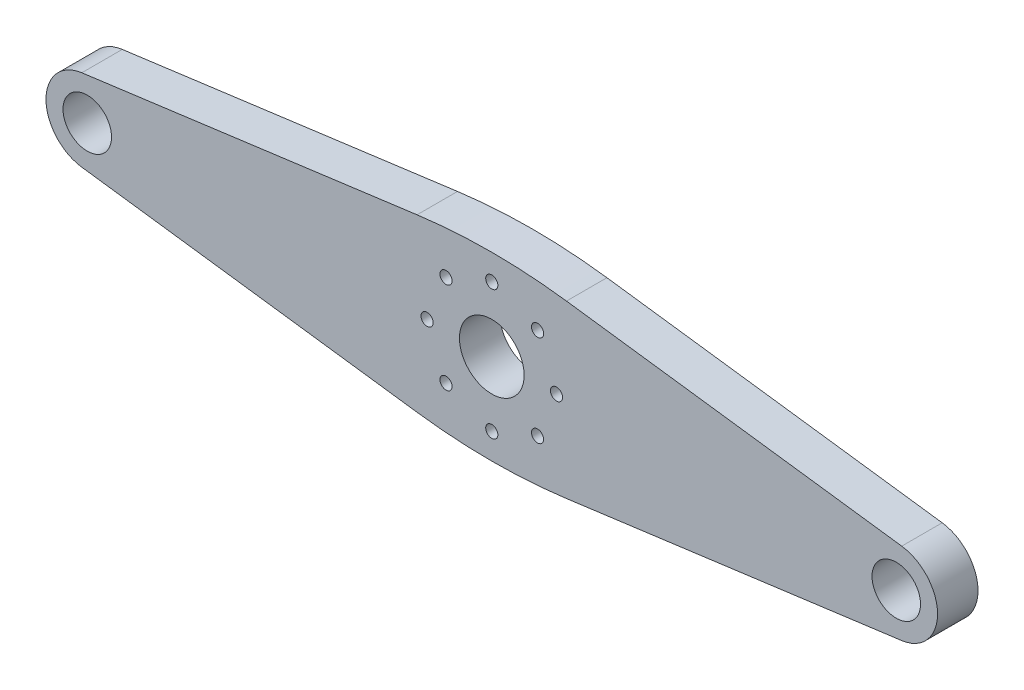
ISO-10303-21;
HEADER;
FILE_DESCRIPTION(('STEP AP214'),'2;1');
FILE_NAME('part.step','',(''),(''),'','','');
FILE_SCHEMA(('AUTOMOTIVE_DESIGN { 1 0 10303 214 1 1 1 1 }'));
ENDSEC;
DATA;
#1=APPLICATION_CONTEXT('core data for automotive mechanical design processes');
#2=APPLICATION_PROTOCOL_DEFINITION('international standard','automotive_design',2000,#1);
#3=PRODUCT_CONTEXT('',#1,'mechanical');
#4=PRODUCT('Part','Part','',(#3));
#5=PRODUCT_RELATED_PRODUCT_CATEGORY('part','',(#4));
#6=PRODUCT_DEFINITION_FORMATION('','',#4);
#7=PRODUCT_DEFINITION_CONTEXT('part definition',#1,'design');
#8=PRODUCT_DEFINITION('design','',#6,#7);
#9=PRODUCT_DEFINITION_SHAPE('','',#8);
#10=(LENGTH_UNIT() NAMED_UNIT(*) SI_UNIT(.MILLI.,.METRE.));
#11=(NAMED_UNIT(*) PLANE_ANGLE_UNIT() SI_UNIT($,.RADIAN.));
#12=(NAMED_UNIT(*) SI_UNIT($,.STERADIAN.) SOLID_ANGLE_UNIT());
#13=UNCERTAINTY_MEASURE_WITH_UNIT(LENGTH_MEASURE(1.E-05),#10,'distance_accuracy_value','');
#14=(GEOMETRIC_REPRESENTATION_CONTEXT(3) GLOBAL_UNCERTAINTY_ASSIGNED_CONTEXT((#13)) GLOBAL_UNIT_ASSIGNED_CONTEXT((#10,
#11,#12)) REPRESENTATION_CONTEXT('',''));
#15=CARTESIAN_POINT('',(0.,0.,0.));
#16=DIRECTION('',(0.,0.,1.));
#17=DIRECTION('',(1.,0.,0.));
#18=AXIS2_PLACEMENT_3D('',#15,#16,#17);
#19=CARTESIAN_POINT('',(50.,0.,5.));
#20=DIRECTION('',(0.,0.,-1.));
#21=DIRECTION('',(-1.,0.,0.));
#22=AXIS2_PLACEMENT_3D('',#19,#20,#21);
#23=PLANE('',#22);
#24=CARTESIAN_POINT('',(50.,0.,5.));
#25=DIRECTION('',(0.,0.,1.));
#26=DIRECTION('',(-1.,0.,0.));
#27=AXIS2_PLACEMENT_3D('',#24,#25,#26);
#28=CIRCLE('',#27,5.10024633771241);
#29=CARTESIAN_POINT('',(50.6728763500851,-5.05566515137672,5.));
#30=VERTEX_POINT('',#29);
#31=CARTESIAN_POINT('',(50.6728763500851,5.05566515137672,5.));
#32=VERTEX_POINT('',#31);
#33=EDGE_CURVE('E145',#30,#32,#28,.T.);
#34=ORIENTED_EDGE('',*,*,#33,.T.);
#35=DIRECTION('',(-0.991259013117456,0.131930166805804,0.));
#36=VECTOR('',#35,1.);
#37=CARTESIAN_POINT('',(50.6728763500851,5.05566515137672,5.));
#38=LINE('',#37,#36);
#39=CARTESIAN_POINT('',(9.2351116764065,10.5707637614413,5.));
#40=VERTEX_POINT('',#39);
#41=EDGE_CURVE('E93',#32,#40,#38,.T.);
#42=ORIENTED_EDGE('',*,*,#41,.T.);
#43=CARTESIAN_POINT('',(0.,-58.8173671567806,5.));
#44=DIRECTION('',(0.,0.,1.));
#45=DIRECTION('',(-1.,0.,0.));
#46=AXIS2_PLACEMENT_3D('',#43,#44,#45);
#47=CIRCLE('',#46,70.);
#48=CARTESIAN_POINT('',(-9.23511167640649,10.5707637614413,5.));
#49=VERTEX_POINT('',#48);
#50=EDGE_CURVE('E160',#40,#49,#47,.T.);
#51=ORIENTED_EDGE('',*,*,#50,.T.);
#52=DIRECTION('',(-0.991259013117456,-0.131930166805804,0.));
#53=VECTOR('',#52,1.);
#54=CARTESIAN_POINT('',(-50.6728763500851,5.05566515137672,5.));
#55=LINE('',#54,#53);
#56=CARTESIAN_POINT('',(-50.6728763500851,5.05566515137672,5.));
#57=VERTEX_POINT('',#56);
#58=EDGE_CURVE('E173',#49,#57,#55,.T.);
#59=ORIENTED_EDGE('',*,*,#58,.T.);
#60=CARTESIAN_POINT('',(-50.,0.,5.));
#61=DIRECTION('',(0.,0.,1.));
#62=DIRECTION('',(1.,0.,0.));
#63=AXIS2_PLACEMENT_3D('',#60,#61,#62);
#64=CIRCLE('',#63,5.10024633771241);
#65=CARTESIAN_POINT('',(-50.6728763500851,-5.05566515137672,5.));
#66=VERTEX_POINT('',#65);
#67=EDGE_CURVE('E112',#57,#66,#64,.T.);
#68=ORIENTED_EDGE('',*,*,#67,.T.);
#69=DIRECTION('',(0.991259013117456,-0.131930166805804,0.));
#70=VECTOR('',#69,1.);
#71=CARTESIAN_POINT('',(-50.6728763500851,-5.05566515137672,5.));
#72=LINE('',#71,#70);
#73=CARTESIAN_POINT('',(-9.23511167640653,-10.5707637614413,5.));
#74=VERTEX_POINT('',#73);
#75=EDGE_CURVE('E106',#66,#74,#72,.T.);
#76=ORIENTED_EDGE('',*,*,#75,.T.);
#77=CARTESIAN_POINT('',(0.,58.8173671567806,5.));
#78=DIRECTION('',(0.,0.,1.));
#79=DIRECTION('',(1.,0.,0.));
#80=AXIS2_PLACEMENT_3D('',#77,#78,#79);
#81=CIRCLE('',#80,70.);
#82=CARTESIAN_POINT('',(9.23511167640649,-10.5707637614413,5.));
#83=VERTEX_POINT('',#82);
#84=EDGE_CURVE('E110',#74,#83,#81,.T.);
#85=ORIENTED_EDGE('',*,*,#84,.T.);
#86=DIRECTION('',(0.991259013117456,0.131930166805804,0.));
#87=VECTOR('',#86,1.);
#88=CARTESIAN_POINT('',(50.6728763500851,-5.05566515137672,5.));
#89=LINE('',#88,#87);
#90=EDGE_CURVE('E50',#83,#30,#89,.T.);
#91=ORIENTED_EDGE('',*,*,#90,.T.);
#92=EDGE_LOOP('',(#34,#42,#51,#59,#68,#76,#85,#91));
#93=FACE_BOUND('',#92,.T.);
#94=CARTESIAN_POINT('',(0.,0.,5.));
#95=DIRECTION('',(0.,0.,1.));
#96=DIRECTION('',(1.,0.,0.));
#97=AXIS2_PLACEMENT_3D('',#94,#95,#96);
#98=CIRCLE('',#97,4.);
#99=CARTESIAN_POINT('',(4.,0.,5.));
#100=VERTEX_POINT('',#99);
#101=EDGE_CURVE('E134',#100,#100,#98,.T.);
#102=ORIENTED_EDGE('',*,*,#101,.F.);
#103=EDGE_LOOP('',(#102));
#104=FACE_BOUND('',#103,.T.);
#105=CARTESIAN_POINT('',(-8.,0.,5.));
#106=DIRECTION('',(0.,0.,1.));
#107=DIRECTION('',(1.,0.,0.));
#108=AXIS2_PLACEMENT_3D('',#105,#106,#107);
#109=CIRCLE('',#108,0.75);
#110=CARTESIAN_POINT('',(-7.25,0.,5.));
#111=VERTEX_POINT('',#110);
#112=EDGE_CURVE('E182',#111,#111,#109,.T.);
#113=ORIENTED_EDGE('',*,*,#112,.F.);
#114=EDGE_LOOP('',(#113));
#115=FACE_BOUND('',#114,.T.);
#116=CARTESIAN_POINT('',(-50.,0.,5.));
#117=DIRECTION('',(0.,0.,1.));
#118=DIRECTION('',(1.,0.,0.));
#119=AXIS2_PLACEMENT_3D('',#116,#117,#118);
#120=CIRCLE('',#119,3.);
#121=CARTESIAN_POINT('',(-47.,0.,5.));
#122=VERTEX_POINT('',#121);
#123=EDGE_CURVE('E188',#122,#122,#120,.T.);
#124=ORIENTED_EDGE('',*,*,#123,.F.);
#125=EDGE_LOOP('',(#124));
#126=FACE_BOUND('',#125,.T.);
#127=CARTESIAN_POINT('',(-5.65685424949237,5.65685424949239,5.));
#128=DIRECTION('',(0.,0.,1.));
#129=DIRECTION('',(1.,0.,0.));
#130=AXIS2_PLACEMENT_3D('',#127,#128,#129);
#131=CIRCLE('',#130,0.75);
#132=CARTESIAN_POINT('',(-4.90685424949237,5.65685424949239,5.));
#133=VERTEX_POINT('',#132);
#134=EDGE_CURVE('E194',#133,#133,#131,.T.);
#135=ORIENTED_EDGE('',*,*,#134,.F.);
#136=EDGE_LOOP('',(#135));
#137=FACE_BOUND('',#136,.T.);
#138=CARTESIAN_POINT('',(0.,8.,5.));
#139=DIRECTION('',(0.,0.,1.));
#140=DIRECTION('',(1.,0.,0.));
#141=AXIS2_PLACEMENT_3D('',#138,#139,#140);
#142=CIRCLE('',#141,0.75);
#143=CARTESIAN_POINT('',(0.75000000000003,8.,5.));
#144=VERTEX_POINT('',#143);
#145=EDGE_CURVE('E200',#144,#144,#142,.T.);
#146=ORIENTED_EDGE('',*,*,#145,.F.);
#147=EDGE_LOOP('',(#146));
#148=FACE_BOUND('',#147,.T.);
#149=CARTESIAN_POINT('',(50.,0.,5.));
#150=DIRECTION('',(0.,0.,1.));
#151=DIRECTION('',(-1.,0.,0.));
#152=AXIS2_PLACEMENT_3D('',#149,#150,#151);
#153=CIRCLE('',#152,3.);
#154=CARTESIAN_POINT('',(47.,0.,5.));
#155=VERTEX_POINT('',#154);
#156=EDGE_CURVE('E206',#155,#155,#153,.T.);
#157=ORIENTED_EDGE('',*,*,#156,.F.);
#158=EDGE_LOOP('',(#157));
#159=FACE_BOUND('',#158,.T.);
#160=CARTESIAN_POINT('',(5.65685424949241,5.65685424949235,5.));
#161=DIRECTION('',(0.,0.,1.));
#162=DIRECTION('',(1.,0.,0.));
#163=AXIS2_PLACEMENT_3D('',#160,#161,#162);
#164=CIRCLE('',#163,0.75);
#165=CARTESIAN_POINT('',(6.40685424949241,5.65685424949235,5.));
#166=VERTEX_POINT('',#165);
#167=EDGE_CURVE('E212',#166,#166,#164,.T.);
#168=ORIENTED_EDGE('',*,*,#167,.F.);
#169=EDGE_LOOP('',(#168));
#170=FACE_BOUND('',#169,.T.);
#171=CARTESIAN_POINT('',(8.,0.,5.));
#172=DIRECTION('',(0.,0.,1.));
#173=DIRECTION('',(1.,0.,0.));
#174=AXIS2_PLACEMENT_3D('',#171,#172,#173);
#175=CIRCLE('',#174,0.75);
#176=CARTESIAN_POINT('',(8.75,0.,5.));
#177=VERTEX_POINT('',#176);
#178=EDGE_CURVE('E218',#177,#177,#175,.T.);
#179=ORIENTED_EDGE('',*,*,#178,.F.);
#180=EDGE_LOOP('',(#179));
#181=FACE_BOUND('',#180,.T.);
#182=CARTESIAN_POINT('',(5.65685424949233,-5.65685424949243,5.));
#183=DIRECTION('',(0.,0.,1.));
#184=DIRECTION('',(1.,0.,0.));
#185=AXIS2_PLACEMENT_3D('',#182,#183,#184);
#186=CIRCLE('',#185,0.750000000000001);
#187=CARTESIAN_POINT('',(6.40685424949233,-5.65685424949243,5.));
#188=VERTEX_POINT('',#187);
#189=EDGE_CURVE('E224',#188,#188,#186,.T.);
#190=ORIENTED_EDGE('',*,*,#189,.F.);
#191=EDGE_LOOP('',(#190));
#192=FACE_BOUND('',#191,.T.);
#193=CARTESIAN_POINT('',(0.,-8.,5.));
#194=DIRECTION('',(0.,0.,1.));
#195=DIRECTION('',(1.,0.,0.));
#196=AXIS2_PLACEMENT_3D('',#193,#194,#195);
#197=CIRCLE('',#196,0.750000000000001);
#198=CARTESIAN_POINT('',(0.749999999999915,-8.,5.));
#199=VERTEX_POINT('',#198);
#200=EDGE_CURVE('E230',#199,#199,#197,.T.);
#201=ORIENTED_EDGE('',*,*,#200,.F.);
#202=EDGE_LOOP('',(#201));
#203=FACE_BOUND('',#202,.T.);
#204=CARTESIAN_POINT('',(-5.65685424949245,-5.65685424949231,5.));
#205=DIRECTION('',(0.,0.,1.));
#206=DIRECTION('',(1.,0.,0.));
#207=AXIS2_PLACEMENT_3D('',#204,#205,#206);
#208=CIRCLE('',#207,0.75);
#209=CARTESIAN_POINT('',(-4.90685424949245,-5.65685424949231,5.));
#210=VERTEX_POINT('',#209);
#211=EDGE_CURVE('E236',#210,#210,#208,.T.);
#212=ORIENTED_EDGE('',*,*,#211,.F.);
#213=EDGE_LOOP('',(#212));
#214=FACE_BOUND('',#213,.T.);
#215=ADVANCED_FACE('F33',(#93,#104,#115,#126,#137,#148,#159,#170,#181,#192,#203,#214),#23,.F.);
#216=CARTESIAN_POINT('',(50.,0.,0.));
#217=DIRECTION('',(0.,0.,-1.));
#218=DIRECTION('',(-1.,0.,0.));
#219=AXIS2_PLACEMENT_3D('',#216,#217,#218);
#220=PLANE('',#219);
#221=CARTESIAN_POINT('',(0.,-8.,0.));
#222=DIRECTION('',(0.,0.,1.));
#223=DIRECTION('',(1.,0.,0.));
#224=AXIS2_PLACEMENT_3D('',#221,#222,#223);
#225=CIRCLE('',#224,0.750000000000001);
#226=CARTESIAN_POINT('',(0.749999999999915,-8.,0.));
#227=VERTEX_POINT('',#226);
#228=EDGE_CURVE('E233',#227,#227,#225,.T.);
#229=ORIENTED_EDGE('',*,*,#228,.T.);
#230=EDGE_LOOP('',(#229));
#231=FACE_BOUND('',#230,.T.);
#232=CARTESIAN_POINT('',(8.,0.,0.));
#233=DIRECTION('',(0.,0.,1.));
#234=DIRECTION('',(1.,0.,0.));
#235=AXIS2_PLACEMENT_3D('',#232,#233,#234);
#236=CIRCLE('',#235,0.75);
#237=CARTESIAN_POINT('',(8.75,0.,0.));
#238=VERTEX_POINT('',#237);
#239=EDGE_CURVE('E221',#238,#238,#236,.T.);
#240=ORIENTED_EDGE('',*,*,#239,.T.);
#241=EDGE_LOOP('',(#240));
#242=FACE_BOUND('',#241,.T.);
#243=CARTESIAN_POINT('',(50.,0.,0.));
#244=DIRECTION('',(0.,0.,1.));
#245=DIRECTION('',(-1.,0.,0.));
#246=AXIS2_PLACEMENT_3D('',#243,#244,#245);
#247=CIRCLE('',#246,3.);
#248=CARTESIAN_POINT('',(47.,0.,0.));
#249=VERTEX_POINT('',#248);
#250=EDGE_CURVE('E209',#249,#249,#247,.T.);
#251=ORIENTED_EDGE('',*,*,#250,.T.);
#252=EDGE_LOOP('',(#251));
#253=FACE_BOUND('',#252,.T.);
#254=CARTESIAN_POINT('',(-5.65685424949237,5.65685424949239,0.));
#255=DIRECTION('',(0.,0.,1.));
#256=DIRECTION('',(1.,0.,0.));
#257=AXIS2_PLACEMENT_3D('',#254,#255,#256);
#258=CIRCLE('',#257,0.75);
#259=CARTESIAN_POINT('',(-4.90685424949237,5.65685424949239,0.));
#260=VERTEX_POINT('',#259);
#261=EDGE_CURVE('E197',#260,#260,#258,.T.);
#262=ORIENTED_EDGE('',*,*,#261,.T.);
#263=EDGE_LOOP('',(#262));
#264=FACE_BOUND('',#263,.T.);
#265=CARTESIAN_POINT('',(-8.,0.,0.));
#266=DIRECTION('',(0.,0.,1.));
#267=DIRECTION('',(1.,0.,0.));
#268=AXIS2_PLACEMENT_3D('',#265,#266,#267);
#269=CIRCLE('',#268,0.75);
#270=CARTESIAN_POINT('',(-7.25,0.,0.));
#271=VERTEX_POINT('',#270);
#272=EDGE_CURVE('E185',#271,#271,#269,.T.);
#273=ORIENTED_EDGE('',*,*,#272,.T.);
#274=EDGE_LOOP('',(#273));
#275=FACE_BOUND('',#274,.T.);
#276=CARTESIAN_POINT('',(50.,0.,0.));
#277=DIRECTION('',(0.,0.,1.));
#278=DIRECTION('',(-1.,0.,0.));
#279=AXIS2_PLACEMENT_3D('',#276,#277,#278);
#280=CIRCLE('',#279,5.10024633771241);
#281=CARTESIAN_POINT('',(50.6728763500851,-5.05566515137672,0.));
#282=VERTEX_POINT('',#281);
#283=CARTESIAN_POINT('',(50.6728763500851,5.05566515137672,0.));
#284=VERTEX_POINT('',#283);
#285=EDGE_CURVE('E130',#282,#284,#280,.T.);
#286=ORIENTED_EDGE('',*,*,#285,.F.);
#287=DIRECTION('',(0.991259013117456,0.131930166805804,0.));
#288=VECTOR('',#287,1.);
#289=CARTESIAN_POINT('',(50.6728763500851,-5.05566515137672,0.));
#290=LINE('',#289,#288);
#291=CARTESIAN_POINT('',(9.23511167640649,-10.5707637614413,0.));
#292=VERTEX_POINT('',#291);
#293=EDGE_CURVE('E85',#292,#282,#290,.T.);
#294=ORIENTED_EDGE('',*,*,#293,.F.);
#295=CARTESIAN_POINT('',(0.,58.8173671567806,0.));
#296=DIRECTION('',(0.,0.,1.));
#297=DIRECTION('',(1.,0.,0.));
#298=AXIS2_PLACEMENT_3D('',#295,#296,#297);
#299=CIRCLE('',#298,70.);
#300=CARTESIAN_POINT('',(-9.23511167640653,-10.5707637614413,0.));
#301=VERTEX_POINT('',#300);
#302=EDGE_CURVE('E79',#301,#292,#299,.T.);
#303=ORIENTED_EDGE('',*,*,#302,.F.);
#304=DIRECTION('',(0.991259013117456,-0.131930166805804,0.));
#305=VECTOR('',#304,1.);
#306=CARTESIAN_POINT('',(-50.6728763500851,-5.05566515137672,0.));
#307=LINE('',#306,#305);
#308=CARTESIAN_POINT('',(-50.6728763500851,-5.05566515137672,0.));
#309=VERTEX_POINT('',#308);
#310=EDGE_CURVE('E120',#309,#301,#307,.T.);
#311=ORIENTED_EDGE('',*,*,#310,.F.);
#312=CARTESIAN_POINT('',(-50.,0.,0.));
#313=DIRECTION('',(0.,0.,1.));
#314=DIRECTION('',(1.,0.,0.));
#315=AXIS2_PLACEMENT_3D('',#312,#313,#314);
#316=CIRCLE('',#315,5.10024633771241);
#317=CARTESIAN_POINT('',(-50.6728763500851,5.05566515137672,0.));
#318=VERTEX_POINT('',#317);
#319=EDGE_CURVE('E140',#318,#309,#316,.T.);
#320=ORIENTED_EDGE('',*,*,#319,.F.);
#321=DIRECTION('',(-0.991259013117456,-0.131930166805804,0.));
#322=VECTOR('',#321,1.);
#323=CARTESIAN_POINT('',(-50.6728763500851,5.05566515137672,0.));
#324=LINE('',#323,#322);
#325=CARTESIAN_POINT('',(-9.23511167640649,10.5707637614413,0.));
#326=VERTEX_POINT('',#325);
#327=EDGE_CURVE('E138',#326,#318,#324,.T.);
#328=ORIENTED_EDGE('',*,*,#327,.F.);
#329=CARTESIAN_POINT('',(0.,-58.8173671567806,0.));
#330=DIRECTION('',(0.,0.,1.));
#331=DIRECTION('',(-1.,0.,0.));
#332=AXIS2_PLACEMENT_3D('',#329,#330,#331);
#333=CIRCLE('',#332,70.);
#334=CARTESIAN_POINT('',(9.2351116764065,10.5707637614413,0.));
#335=VERTEX_POINT('',#334);
#336=EDGE_CURVE('E136',#335,#326,#333,.T.);
#337=ORIENTED_EDGE('',*,*,#336,.F.);
#338=DIRECTION('',(-0.991259013117456,0.131930166805804,0.));
#339=VECTOR('',#338,1.);
#340=CARTESIAN_POINT('',(50.6728763500851,5.05566515137672,0.));
#341=LINE('',#340,#339);
#342=EDGE_CURVE('E133',#284,#335,#341,.T.);
#343=ORIENTED_EDGE('',*,*,#342,.F.);
#344=EDGE_LOOP('',(#286,#294,#303,#311,#320,#328,#337,#343));
#345=FACE_BOUND('',#344,.T.);
#346=CARTESIAN_POINT('',(0.,0.,0.));
#347=DIRECTION('',(0.,0.,1.));
#348=DIRECTION('',(1.,0.,0.));
#349=AXIS2_PLACEMENT_3D('',#346,#347,#348);
#350=CIRCLE('',#349,4.);
#351=CARTESIAN_POINT('',(4.,0.,0.));
#352=VERTEX_POINT('',#351);
#353=EDGE_CURVE('E179',#352,#352,#350,.T.);
#354=ORIENTED_EDGE('',*,*,#353,.T.);
#355=EDGE_LOOP('',(#354));
#356=FACE_BOUND('',#355,.T.);
#357=CARTESIAN_POINT('',(-50.,0.,0.));
#358=DIRECTION('',(0.,0.,1.));
#359=DIRECTION('',(1.,0.,0.));
#360=AXIS2_PLACEMENT_3D('',#357,#358,#359);
#361=CIRCLE('',#360,3.);
#362=CARTESIAN_POINT('',(-47.,0.,0.));
#363=VERTEX_POINT('',#362);
#364=EDGE_CURVE('E191',#363,#363,#361,.T.);
#365=ORIENTED_EDGE('',*,*,#364,.T.);
#366=EDGE_LOOP('',(#365));
#367=FACE_BOUND('',#366,.T.);
#368=CARTESIAN_POINT('',(0.,8.,0.));
#369=DIRECTION('',(0.,0.,1.));
#370=DIRECTION('',(1.,0.,0.));
#371=AXIS2_PLACEMENT_3D('',#368,#369,#370);
#372=CIRCLE('',#371,0.75);
#373=CARTESIAN_POINT('',(0.75000000000003,8.,0.));
#374=VERTEX_POINT('',#373);
#375=EDGE_CURVE('E203',#374,#374,#372,.T.);
#376=ORIENTED_EDGE('',*,*,#375,.T.);
#377=EDGE_LOOP('',(#376));
#378=FACE_BOUND('',#377,.T.);
#379=CARTESIAN_POINT('',(5.65685424949241,5.65685424949235,0.));
#380=DIRECTION('',(0.,0.,1.));
#381=DIRECTION('',(1.,0.,0.));
#382=AXIS2_PLACEMENT_3D('',#379,#380,#381);
#383=CIRCLE('',#382,0.75);
#384=CARTESIAN_POINT('',(6.40685424949241,5.65685424949235,0.));
#385=VERTEX_POINT('',#384);
#386=EDGE_CURVE('E215',#385,#385,#383,.T.);
#387=ORIENTED_EDGE('',*,*,#386,.T.);
#388=EDGE_LOOP('',(#387));
#389=FACE_BOUND('',#388,.T.);
#390=CARTESIAN_POINT('',(5.65685424949233,-5.65685424949243,0.));
#391=DIRECTION('',(0.,0.,1.));
#392=DIRECTION('',(1.,0.,0.));
#393=AXIS2_PLACEMENT_3D('',#390,#391,#392);
#394=CIRCLE('',#393,0.750000000000001);
#395=CARTESIAN_POINT('',(6.40685424949233,-5.65685424949243,0.));
#396=VERTEX_POINT('',#395);
#397=EDGE_CURVE('E227',#396,#396,#394,.T.);
#398=ORIENTED_EDGE('',*,*,#397,.T.);
#399=EDGE_LOOP('',(#398));
#400=FACE_BOUND('',#399,.T.);
#401=CARTESIAN_POINT('',(-5.65685424949245,-5.65685424949231,0.));
#402=DIRECTION('',(0.,0.,1.));
#403=DIRECTION('',(1.,0.,0.));
#404=AXIS2_PLACEMENT_3D('',#401,#402,#403);
#405=CIRCLE('',#404,0.75);
#406=CARTESIAN_POINT('',(-4.90685424949245,-5.65685424949231,0.));
#407=VERTEX_POINT('',#406);
#408=EDGE_CURVE('E239',#407,#407,#405,.T.);
#409=ORIENTED_EDGE('',*,*,#408,.T.);
#410=EDGE_LOOP('',(#409));
#411=FACE_BOUND('',#410,.T.);
#412=ADVANCED_FACE('F164',(#231,#242,#253,#264,#275,#345,#356,#367,#378,#389,#400,#411),#220,.T.);
#413=CARTESIAN_POINT('',(50.,0.,5.));
#414=DIRECTION('',(0.,0.,-1.));
#415=DIRECTION('',(-1.,0.,0.));
#416=AXIS2_PLACEMENT_3D('',#413,#414,#415);
#417=CYLINDRICAL_SURFACE('',#416,5.10024633771241);
#418=ORIENTED_EDGE('',*,*,#285,.T.);
#419=DIRECTION('',(0.,0.,-1.));
#420=VECTOR('',#419,1.);
#421=CARTESIAN_POINT('',(50.6728763500851,5.05566515137672,5.));
#422=LINE('',#421,#420);
#423=EDGE_CURVE('E11',#32,#284,#422,.T.);
#424=ORIENTED_EDGE('',*,*,#423,.F.);
#425=ORIENTED_EDGE('',*,*,#33,.F.);
#426=DIRECTION('',(0.,0.,-1.));
#427=VECTOR('',#426,1.);
#428=CARTESIAN_POINT('',(50.6728763500851,-5.05566515137672,5.));
#429=LINE('',#428,#427);
#430=EDGE_CURVE('E126',#30,#282,#429,.T.);
#431=ORIENTED_EDGE('',*,*,#430,.T.);
#432=EDGE_LOOP('',(#418,#424,#425,#431));
#433=FACE_BOUND('',#432,.T.);
#434=ADVANCED_FACE('F35',(#433),#417,.T.);
#435=CARTESIAN_POINT('',(50.6728763500851,5.05566515137672,5.));
#436=DIRECTION('',(-0.131930166805804,-0.991259013117456,0.));
#437=DIRECTION('',(0.991259013117456,-0.131930166805804,0.));
#438=AXIS2_PLACEMENT_3D('',#435,#436,#437);
#439=PLANE('',#438);
#440=ORIENTED_EDGE('',*,*,#342,.T.);
#441=DIRECTION('',(0.,0.,-1.));
#442=VECTOR('',#441,1.);
#443=CARTESIAN_POINT('',(9.2351116764065,10.5707637614413,5.));
#444=LINE('',#443,#442);
#445=EDGE_CURVE('E42',#40,#335,#444,.T.);
#446=ORIENTED_EDGE('',*,*,#445,.F.);
#447=ORIENTED_EDGE('',*,*,#41,.F.);
#448=ORIENTED_EDGE('',*,*,#423,.T.);
#449=EDGE_LOOP('',(#440,#446,#447,#448));
#450=FACE_BOUND('',#449,.T.);
#451=ADVANCED_FACE('F271',(#450),#439,.F.);
#452=CARTESIAN_POINT('',(0.,-58.8173671567806,5.));
#453=DIRECTION('',(0.,0.,-1.));
#454=DIRECTION('',(-1.,0.,0.));
#455=AXIS2_PLACEMENT_3D('',#452,#453,#454);
#456=CYLINDRICAL_SURFACE('',#455,70.);
#457=ORIENTED_EDGE('',*,*,#336,.T.);
#458=DIRECTION('',(0.,0.,-1.));
#459=VECTOR('',#458,1.);
#460=CARTESIAN_POINT('',(-9.23511167640649,10.5707637614413,5.));
#461=LINE('',#460,#459);
#462=EDGE_CURVE('E152',#49,#326,#461,.T.);
#463=ORIENTED_EDGE('',*,*,#462,.F.);
#464=ORIENTED_EDGE('',*,*,#50,.F.);
#465=ORIENTED_EDGE('',*,*,#445,.T.);
#466=EDGE_LOOP('',(#457,#463,#464,#465));
#467=FACE_BOUND('',#466,.T.);
#468=ADVANCED_FACE('F158',(#467),#456,.T.);
#469=CARTESIAN_POINT('',(-50.6728763500851,5.05566515137672,5.));
#470=DIRECTION('',(0.131930166805804,-0.991259013117456,0.));
#471=DIRECTION('',(0.991259013117456,0.131930166805804,0.));
#472=AXIS2_PLACEMENT_3D('',#469,#470,#471);
#473=PLANE('',#472);
#474=ORIENTED_EDGE('',*,*,#327,.T.);
#475=DIRECTION('',(0.,0.,-1.));
#476=VECTOR('',#475,1.);
#477=CARTESIAN_POINT('',(-50.6728763500851,5.05566515137672,5.));
#478=LINE('',#477,#476);
#479=EDGE_CURVE('E149',#57,#318,#478,.T.);
#480=ORIENTED_EDGE('',*,*,#479,.F.);
#481=ORIENTED_EDGE('',*,*,#58,.F.);
#482=ORIENTED_EDGE('',*,*,#462,.T.);
#483=EDGE_LOOP('',(#474,#480,#481,#482));
#484=FACE_BOUND('',#483,.T.);
#485=ADVANCED_FACE('F169',(#484),#473,.F.);
#486=CARTESIAN_POINT('',(-50.,0.,5.));
#487=DIRECTION('',(0.,0.,-1.));
#488=DIRECTION('',(-1.,0.,0.));
#489=AXIS2_PLACEMENT_3D('',#486,#487,#488);
#490=CYLINDRICAL_SURFACE('',#489,5.10024633771241);
#491=ORIENTED_EDGE('',*,*,#319,.T.);
#492=DIRECTION('',(0.,0.,-1.));
#493=VECTOR('',#492,1.);
#494=CARTESIAN_POINT('',(-50.6728763500851,-5.05566515137672,5.));
#495=LINE('',#494,#493);
#496=EDGE_CURVE('E121',#66,#309,#495,.T.);
#497=ORIENTED_EDGE('',*,*,#496,.F.);
#498=ORIENTED_EDGE('',*,*,#67,.F.);
#499=ORIENTED_EDGE('',*,*,#479,.T.);
#500=EDGE_LOOP('',(#491,#497,#498,#499));
#501=FACE_BOUND('',#500,.T.);
#502=ADVANCED_FACE('F172',(#501),#490,.T.);
#503=CARTESIAN_POINT('',(-50.6728763500851,-5.05566515137672,5.));
#504=DIRECTION('',(0.131930166805804,0.991259013117456,0.));
#505=DIRECTION('',(-0.991259013117456,0.131930166805804,0.));
#506=AXIS2_PLACEMENT_3D('',#503,#504,#505);
#507=PLANE('',#506);
#508=ORIENTED_EDGE('',*,*,#310,.T.);
#509=DIRECTION('',(0.,0.,-1.));
#510=VECTOR('',#509,1.);
#511=CARTESIAN_POINT('',(-9.23511167640653,-10.5707637614413,5.));
#512=LINE('',#511,#510);
#513=EDGE_CURVE('E117',#74,#301,#512,.T.);
#514=ORIENTED_EDGE('',*,*,#513,.F.);
#515=ORIENTED_EDGE('',*,*,#75,.F.);
#516=ORIENTED_EDGE('',*,*,#496,.T.);
#517=EDGE_LOOP('',(#508,#514,#515,#516));
#518=FACE_BOUND('',#517,.T.);
#519=ADVANCED_FACE('F118',(#518),#507,.F.);
#520=CARTESIAN_POINT('',(0.,58.8173671567806,5.));
#521=DIRECTION('',(0.,0.,-1.));
#522=DIRECTION('',(-1.,0.,0.));
#523=AXIS2_PLACEMENT_3D('',#520,#521,#522);
#524=CYLINDRICAL_SURFACE('',#523,70.);
#525=ORIENTED_EDGE('',*,*,#302,.T.);
#526=DIRECTION('',(0.,0.,-1.));
#527=VECTOR('',#526,1.);
#528=CARTESIAN_POINT('',(9.23511167640649,-10.5707637614413,5.));
#529=LINE('',#528,#527);
#530=EDGE_CURVE('E122',#83,#292,#529,.T.);
#531=ORIENTED_EDGE('',*,*,#530,.F.);
#532=ORIENTED_EDGE('',*,*,#84,.F.);
#533=ORIENTED_EDGE('',*,*,#513,.T.);
#534=EDGE_LOOP('',(#525,#531,#532,#533));
#535=FACE_BOUND('',#534,.T.);
#536=ADVANCED_FACE('F124',(#535),#524,.T.);
#537=CARTESIAN_POINT('',(50.6728763500851,-5.05566515137672,5.));
#538=DIRECTION('',(-0.131930166805804,0.991259013117456,0.));
#539=DIRECTION('',(-0.991259013117456,-0.131930166805804,0.));
#540=AXIS2_PLACEMENT_3D('',#537,#538,#539);
#541=PLANE('',#540);
#542=ORIENTED_EDGE('',*,*,#293,.T.);
#543=ORIENTED_EDGE('',*,*,#430,.F.);
#544=ORIENTED_EDGE('',*,*,#90,.F.);
#545=ORIENTED_EDGE('',*,*,#530,.T.);
#546=EDGE_LOOP('',(#542,#543,#544,#545));
#547=FACE_BOUND('',#546,.T.);
#548=ADVANCED_FACE('F259',(#547),#541,.F.);
#549=CARTESIAN_POINT('',(0.,0.,5.));
#550=DIRECTION('',(0.,0.,-1.));
#551=DIRECTION('',(-1.,0.,0.));
#552=AXIS2_PLACEMENT_3D('',#549,#550,#551);
#553=CYLINDRICAL_SURFACE('',#552,4.);
#554=ORIENTED_EDGE('',*,*,#101,.T.);
#555=EDGE_LOOP('',(#554));
#556=FACE_BOUND('',#555,.T.);
#557=ORIENTED_EDGE('',*,*,#353,.F.);
#558=EDGE_LOOP('',(#557));
#559=FACE_BOUND('',#558,.T.);
#560=ADVANCED_FACE('F256',(#556,#559),#553,.F.);
#561=CARTESIAN_POINT('',(-8.,0.,5.));
#562=DIRECTION('',(0.,0.,-1.));
#563=DIRECTION('',(-1.,0.,0.));
#564=AXIS2_PLACEMENT_3D('',#561,#562,#563);
#565=CYLINDRICAL_SURFACE('',#564,0.75);
#566=ORIENTED_EDGE('',*,*,#112,.T.);
#567=EDGE_LOOP('',(#566));
#568=FACE_BOUND('',#567,.T.);
#569=ORIENTED_EDGE('',*,*,#272,.F.);
#570=EDGE_LOOP('',(#569));
#571=FACE_BOUND('',#570,.T.);
#572=ADVANCED_FACE('F335',(#568,#571),#565,.F.);
#573=CARTESIAN_POINT('',(-50.,0.,5.));
#574=DIRECTION('',(0.,0.,-1.));
#575=DIRECTION('',(-1.,0.,0.));
#576=AXIS2_PLACEMENT_3D('',#573,#574,#575);
#577=CYLINDRICAL_SURFACE('',#576,3.);
#578=ORIENTED_EDGE('',*,*,#123,.T.);
#579=EDGE_LOOP('',(#578));
#580=FACE_BOUND('',#579,.T.);
#581=ORIENTED_EDGE('',*,*,#364,.F.);
#582=EDGE_LOOP('',(#581));
#583=FACE_BOUND('',#582,.T.);
#584=ADVANCED_FACE('F343',(#580,#583),#577,.F.);
#585=CARTESIAN_POINT('',(-5.65685424949237,5.65685424949239,5.));
#586=DIRECTION('',(0.,0.,-1.));
#587=DIRECTION('',(-1.,0.,0.));
#588=AXIS2_PLACEMENT_3D('',#585,#586,#587);
#589=CYLINDRICAL_SURFACE('',#588,0.75);
#590=ORIENTED_EDGE('',*,*,#134,.T.);
#591=EDGE_LOOP('',(#590));
#592=FACE_BOUND('',#591,.T.);
#593=ORIENTED_EDGE('',*,*,#261,.F.);
#594=EDGE_LOOP('',(#593));
#595=FACE_BOUND('',#594,.T.);
#596=ADVANCED_FACE('F351',(#592,#595),#589,.F.);
#597=CARTESIAN_POINT('',(0.,8.,5.));
#598=DIRECTION('',(0.,0.,-1.));
#599=DIRECTION('',(-1.,0.,0.));
#600=AXIS2_PLACEMENT_3D('',#597,#598,#599);
#601=CYLINDRICAL_SURFACE('',#600,0.75);
#602=ORIENTED_EDGE('',*,*,#145,.T.);
#603=EDGE_LOOP('',(#602));
#604=FACE_BOUND('',#603,.T.);
#605=ORIENTED_EDGE('',*,*,#375,.F.);
#606=EDGE_LOOP('',(#605));
#607=FACE_BOUND('',#606,.T.);
#608=ADVANCED_FACE('F360',(#604,#607),#601,.F.);
#609=CARTESIAN_POINT('',(50.,0.,5.));
#610=DIRECTION('',(0.,0.,-1.));
#611=DIRECTION('',(-1.,0.,0.));
#612=AXIS2_PLACEMENT_3D('',#609,#610,#611);
#613=CYLINDRICAL_SURFACE('',#612,3.);
#614=ORIENTED_EDGE('',*,*,#156,.T.);
#615=EDGE_LOOP('',(#614));
#616=FACE_BOUND('',#615,.T.);
#617=ORIENTED_EDGE('',*,*,#250,.F.);
#618=EDGE_LOOP('',(#617));
#619=FACE_BOUND('',#618,.T.);
#620=ADVANCED_FACE('F369',(#616,#619),#613,.F.);
#621=CARTESIAN_POINT('',(5.65685424949241,5.65685424949235,5.));
#622=DIRECTION('',(0.,0.,-1.));
#623=DIRECTION('',(-1.,0.,0.));
#624=AXIS2_PLACEMENT_3D('',#621,#622,#623);
#625=CYLINDRICAL_SURFACE('',#624,0.75);
#626=ORIENTED_EDGE('',*,*,#167,.T.);
#627=EDGE_LOOP('',(#626));
#628=FACE_BOUND('',#627,.T.);
#629=ORIENTED_EDGE('',*,*,#386,.F.);
#630=EDGE_LOOP('',(#629));
#631=FACE_BOUND('',#630,.T.);
#632=ADVANCED_FACE('F378',(#628,#631),#625,.F.);
#633=CARTESIAN_POINT('',(8.,0.,5.));
#634=DIRECTION('',(0.,0.,-1.));
#635=DIRECTION('',(-1.,0.,0.));
#636=AXIS2_PLACEMENT_3D('',#633,#634,#635);
#637=CYLINDRICAL_SURFACE('',#636,0.75);
#638=ORIENTED_EDGE('',*,*,#178,.T.);
#639=EDGE_LOOP('',(#638));
#640=FACE_BOUND('',#639,.T.);
#641=ORIENTED_EDGE('',*,*,#239,.F.);
#642=EDGE_LOOP('',(#641));
#643=FACE_BOUND('',#642,.T.);
#644=ADVANCED_FACE('F387',(#640,#643),#637,.F.);
#645=CARTESIAN_POINT('',(5.65685424949233,-5.65685424949243,5.));
#646=DIRECTION('',(0.,0.,-1.));
#647=DIRECTION('',(-1.,0.,0.));
#648=AXIS2_PLACEMENT_3D('',#645,#646,#647);
#649=CYLINDRICAL_SURFACE('',#648,0.750000000000001);
#650=ORIENTED_EDGE('',*,*,#189,.T.);
#651=EDGE_LOOP('',(#650));
#652=FACE_BOUND('',#651,.T.);
#653=ORIENTED_EDGE('',*,*,#397,.F.);
#654=EDGE_LOOP('',(#653));
#655=FACE_BOUND('',#654,.T.);
#656=ADVANCED_FACE('F396',(#652,#655),#649,.F.);
#657=CARTESIAN_POINT('',(0.,-8.,5.));
#658=DIRECTION('',(0.,0.,-1.));
#659=DIRECTION('',(-1.,0.,0.));
#660=AXIS2_PLACEMENT_3D('',#657,#658,#659);
#661=CYLINDRICAL_SURFACE('',#660,0.750000000000001);
#662=ORIENTED_EDGE('',*,*,#200,.T.);
#663=EDGE_LOOP('',(#662));
#664=FACE_BOUND('',#663,.T.);
#665=ORIENTED_EDGE('',*,*,#228,.F.);
#666=EDGE_LOOP('',(#665));
#667=FACE_BOUND('',#666,.T.);
#668=ADVANCED_FACE('F405',(#664,#667),#661,.F.);
#669=CARTESIAN_POINT('',(-5.65685424949245,-5.65685424949231,5.));
#670=DIRECTION('',(0.,0.,-1.));
#671=DIRECTION('',(-1.,0.,0.));
#672=AXIS2_PLACEMENT_3D('',#669,#670,#671);
#673=CYLINDRICAL_SURFACE('',#672,0.75);
#674=ORIENTED_EDGE('',*,*,#211,.T.);
#675=EDGE_LOOP('',(#674));
#676=FACE_BOUND('',#675,.T.);
#677=ORIENTED_EDGE('',*,*,#408,.F.);
#678=EDGE_LOOP('',(#677));
#679=FACE_BOUND('',#678,.T.);
#680=ADVANCED_FACE('F245',(#676,#679),#673,.F.);
#681=CLOSED_SHELL('',(#215,#412,#434,#451,#468,#485,#502,#519,#536,#548,#560,#572,#584,#596,
#608,#620,#632,#644,#656,#668,#680));
#682=MANIFOLD_SOLID_BREP('B2',#681);
#683=ADVANCED_BREP_SHAPE_REPRESENTATION('',(#18,#682),#14);
#684=SHAPE_DEFINITION_REPRESENTATION(#9,#683);
ENDSEC;
END-ISO-10303-21;
